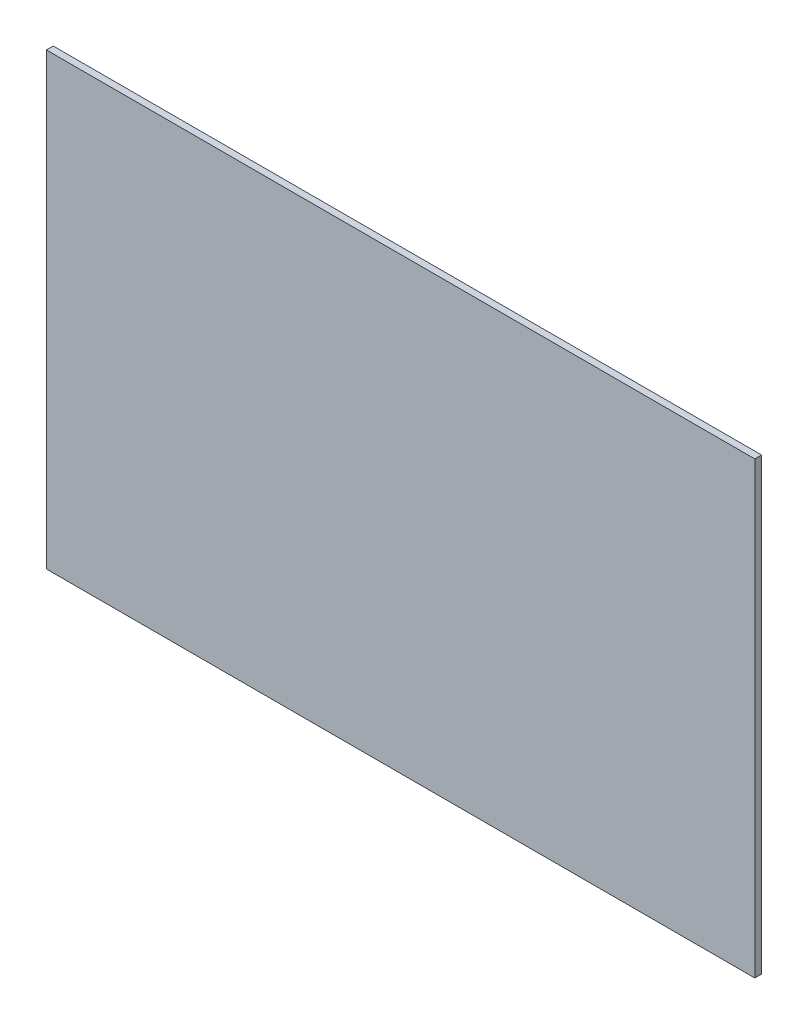
ISO-10303-21;
HEADER;
FILE_DESCRIPTION(('STEP AP214'),'2;1');
FILE_NAME('part.step','',(''),(''),'','','');
FILE_SCHEMA(('AUTOMOTIVE_DESIGN { 1 0 10303 214 1 1 1 1 }'));
ENDSEC;
DATA;
#1=APPLICATION_CONTEXT('core data for automotive mechanical design processes');
#2=APPLICATION_PROTOCOL_DEFINITION('international standard','automotive_design',2000,#1);
#3=PRODUCT_CONTEXT('',#1,'mechanical');
#4=PRODUCT('Part','Part','',(#3));
#5=PRODUCT_RELATED_PRODUCT_CATEGORY('part','',(#4));
#6=PRODUCT_DEFINITION_FORMATION('','',#4);
#7=PRODUCT_DEFINITION_CONTEXT('part definition',#1,'design');
#8=PRODUCT_DEFINITION('design','',#6,#7);
#9=PRODUCT_DEFINITION_SHAPE('','',#8);
#10=(LENGTH_UNIT() NAMED_UNIT(*) SI_UNIT(.MILLI.,.METRE.));
#11=(NAMED_UNIT(*) PLANE_ANGLE_UNIT() SI_UNIT($,.RADIAN.));
#12=(NAMED_UNIT(*) SI_UNIT($,.STERADIAN.) SOLID_ANGLE_UNIT());
#13=UNCERTAINTY_MEASURE_WITH_UNIT(LENGTH_MEASURE(1.E-05),#10,'distance_accuracy_value','');
#14=(GEOMETRIC_REPRESENTATION_CONTEXT(3) GLOBAL_UNCERTAINTY_ASSIGNED_CONTEXT((#13)) GLOBAL_UNIT_ASSIGNED_CONTEXT((#10,
#11,#12)) REPRESENTATION_CONTEXT('',''));
#15=CARTESIAN_POINT('',(0.,0.,0.));
#16=DIRECTION('',(0.,0.,1.));
#17=DIRECTION('',(1.,0.,0.));
#18=AXIS2_PLACEMENT_3D('',#15,#16,#17);
#19=CARTESIAN_POINT('',(-207.989835164835,236.461172161172,5.));
#20=DIRECTION('',(1.,0.,0.));
#21=DIRECTION('',(0.,1.,0.));
#22=AXIS2_PLACEMENT_3D('',#19,#20,#21);
#23=PLANE('',#22);
#24=DIRECTION('',(0.,-1.,0.));
#25=VECTOR('',#24,1.);
#26=CARTESIAN_POINT('',(-207.989835164835,236.461172161172,0.));
#27=LINE('',#26,#25);
#28=CARTESIAN_POINT('',(-207.989835164835,236.461172161172,0.));
#29=VERTEX_POINT('',#28);
#30=CARTESIAN_POINT('',(-207.989835164835,-93.5388278388279,0.));
#31=VERTEX_POINT('',#30);
#32=EDGE_CURVE('E107',#29,#31,#27,.T.);
#33=ORIENTED_EDGE('',*,*,#32,.T.);
#34=DIRECTION('',(0.,0.,-1.));
#35=VECTOR('',#34,1.);
#36=CARTESIAN_POINT('',(-207.989835164835,-93.5388278388279,5.));
#37=LINE('',#36,#35);
#38=CARTESIAN_POINT('',(-207.989835164835,-93.5388278388279,5.));
#39=VERTEX_POINT('',#38);
#40=EDGE_CURVE('E11',#39,#31,#37,.T.);
#41=ORIENTED_EDGE('',*,*,#40,.F.);
#42=DIRECTION('',(0.,-1.,0.));
#43=VECTOR('',#42,1.);
#44=CARTESIAN_POINT('',(-207.989835164835,236.461172161172,5.));
#45=LINE('',#44,#43);
#46=CARTESIAN_POINT('',(-207.989835164835,236.461172161172,5.));
#47=VERTEX_POINT('',#46);
#48=EDGE_CURVE('E91',#47,#39,#45,.T.);
#49=ORIENTED_EDGE('',*,*,#48,.F.);
#50=DIRECTION('',(0.,0.,-1.));
#51=VECTOR('',#50,1.);
#52=CARTESIAN_POINT('',(-207.989835164835,236.461172161172,5.));
#53=LINE('',#52,#51);
#54=EDGE_CURVE('E103',#47,#29,#53,.T.);
#55=ORIENTED_EDGE('',*,*,#54,.T.);
#56=EDGE_LOOP('',(#33,#41,#49,#55));
#57=FACE_BOUND('',#56,.T.);
#58=ADVANCED_FACE('F39',(#57),#23,.F.);
#59=CARTESIAN_POINT('',(-207.989835164835,-93.5388278388279,5.));
#60=DIRECTION('',(0.,1.,0.));
#61=DIRECTION('',(0.,0.,1.));
#62=AXIS2_PLACEMENT_3D('',#59,#60,#61);
#63=PLANE('',#62);
#64=DIRECTION('',(1.,0.,0.));
#65=VECTOR('',#64,1.);
#66=CARTESIAN_POINT('',(-207.989835164835,-93.5388278388279,0.));
#67=LINE('',#66,#65);
#68=CARTESIAN_POINT('',(312.010164835165,-93.5388278388279,0.));
#69=VERTEX_POINT('',#68);
#70=EDGE_CURVE('E96',#31,#69,#67,.T.);
#71=ORIENTED_EDGE('',*,*,#70,.T.);
#72=DIRECTION('',(0.,0.,-1.));
#73=VECTOR('',#72,1.);
#74=CARTESIAN_POINT('',(312.010164835165,-93.5388278388279,5.));
#75=LINE('',#74,#73);
#76=CARTESIAN_POINT('',(312.010164835165,-93.5388278388279,5.));
#77=VERTEX_POINT('',#76);
#78=EDGE_CURVE('E48',#77,#69,#75,.T.);
#79=ORIENTED_EDGE('',*,*,#78,.F.);
#80=DIRECTION('',(1.,0.,0.));
#81=VECTOR('',#80,1.);
#82=CARTESIAN_POINT('',(-207.989835164835,-93.5388278388279,5.));
#83=LINE('',#82,#81);
#84=EDGE_CURVE('E86',#39,#77,#83,.T.);
#85=ORIENTED_EDGE('',*,*,#84,.F.);
#86=ORIENTED_EDGE('',*,*,#40,.T.);
#87=EDGE_LOOP('',(#71,#79,#85,#86));
#88=FACE_BOUND('',#87,.T.);
#89=ADVANCED_FACE('F95',(#88),#63,.F.);
#90=CARTESIAN_POINT('',(312.010164835165,236.461172161172,5.));
#91=DIRECTION('',(-1.,0.,0.));
#92=DIRECTION('',(0.,-1.,0.));
#93=AXIS2_PLACEMENT_3D('',#90,#91,#92);
#94=PLANE('',#93);
#95=DIRECTION('',(0.,1.,0.));
#96=VECTOR('',#95,1.);
#97=CARTESIAN_POINT('',(312.010164835165,236.461172161172,0.));
#98=LINE('',#97,#96);
#99=CARTESIAN_POINT('',(312.010164835165,236.461172161172,0.));
#100=VERTEX_POINT('',#99);
#101=EDGE_CURVE('E73',#69,#100,#98,.T.);
#102=ORIENTED_EDGE('',*,*,#101,.T.);
#103=DIRECTION('',(0.,0.,-1.));
#104=VECTOR('',#103,1.);
#105=CARTESIAN_POINT('',(312.010164835165,236.461172161172,5.));
#106=LINE('',#105,#104);
#107=CARTESIAN_POINT('',(312.010164835165,236.461172161172,5.));
#108=VERTEX_POINT('',#107);
#109=EDGE_CURVE('E98',#108,#100,#106,.T.);
#110=ORIENTED_EDGE('',*,*,#109,.F.);
#111=DIRECTION('',(0.,1.,0.));
#112=VECTOR('',#111,1.);
#113=CARTESIAN_POINT('',(312.010164835165,236.461172161172,5.));
#114=LINE('',#113,#112);
#115=EDGE_CURVE('E89',#77,#108,#114,.T.);
#116=ORIENTED_EDGE('',*,*,#115,.F.);
#117=ORIENTED_EDGE('',*,*,#78,.T.);
#118=EDGE_LOOP('',(#102,#110,#116,#117));
#119=FACE_BOUND('',#118,.T.);
#120=ADVANCED_FACE('F99',(#119),#94,.F.);
#121=CARTESIAN_POINT('',(-207.989835164835,236.461172161172,5.));
#122=DIRECTION('',(0.,-1.,0.));
#123=DIRECTION('',(0.,0.,-1.));
#124=AXIS2_PLACEMENT_3D('',#121,#122,#123);
#125=PLANE('',#124);
#126=DIRECTION('',(-1.,0.,0.));
#127=VECTOR('',#126,1.);
#128=CARTESIAN_POINT('',(-207.989835164835,236.461172161172,0.));
#129=LINE('',#128,#127);
#130=EDGE_CURVE('E79',#100,#29,#129,.T.);
#131=ORIENTED_EDGE('',*,*,#130,.T.);
#132=ORIENTED_EDGE('',*,*,#54,.F.);
#133=DIRECTION('',(-1.,0.,0.));
#134=VECTOR('',#133,1.);
#135=CARTESIAN_POINT('',(-207.989835164835,236.461172161172,5.));
#136=LINE('',#135,#134);
#137=EDGE_CURVE('E56',#108,#47,#136,.T.);
#138=ORIENTED_EDGE('',*,*,#137,.F.);
#139=ORIENTED_EDGE('',*,*,#109,.T.);
#140=EDGE_LOOP('',(#131,#132,#138,#139));
#141=FACE_BOUND('',#140,.T.);
#142=ADVANCED_FACE('F120',(#141),#125,.F.);
#143=CARTESIAN_POINT('',(0.,0.,5.));
#144=DIRECTION('',(0.,0.,1.));
#145=DIRECTION('',(1.,0.,0.));
#146=AXIS2_PLACEMENT_3D('',#143,#144,#145);
#147=PLANE('',#146);
#148=ORIENTED_EDGE('',*,*,#48,.T.);
#149=ORIENTED_EDGE('',*,*,#84,.T.);
#150=ORIENTED_EDGE('',*,*,#115,.T.);
#151=ORIENTED_EDGE('',*,*,#137,.T.);
#152=EDGE_LOOP('',(#148,#149,#150,#151));
#153=FACE_BOUND('',#152,.T.);
#154=ADVANCED_FACE('F87',(#153),#147,.T.);
#155=CARTESIAN_POINT('',(0.,0.,0.));
#156=DIRECTION('',(0.,0.,1.));
#157=DIRECTION('',(1.,0.,0.));
#158=AXIS2_PLACEMENT_3D('',#155,#156,#157);
#159=PLANE('',#158);
#160=ORIENTED_EDGE('',*,*,#32,.F.);
#161=ORIENTED_EDGE('',*,*,#130,.F.);
#162=ORIENTED_EDGE('',*,*,#101,.F.);
#163=ORIENTED_EDGE('',*,*,#70,.F.);
#164=EDGE_LOOP('',(#160,#161,#162,#163));
#165=FACE_BOUND('',#164,.T.);
#166=ADVANCED_FACE('F123',(#165),#159,.F.);
#167=CLOSED_SHELL('',(#58,#89,#120,#142,#154,#166));
#168=MANIFOLD_SOLID_BREP('B2',#167);
#169=ADVANCED_BREP_SHAPE_REPRESENTATION('',(#18,#168),#14);
#170=SHAPE_DEFINITION_REPRESENTATION(#9,#169);
ENDSEC;
END-ISO-10303-21;
